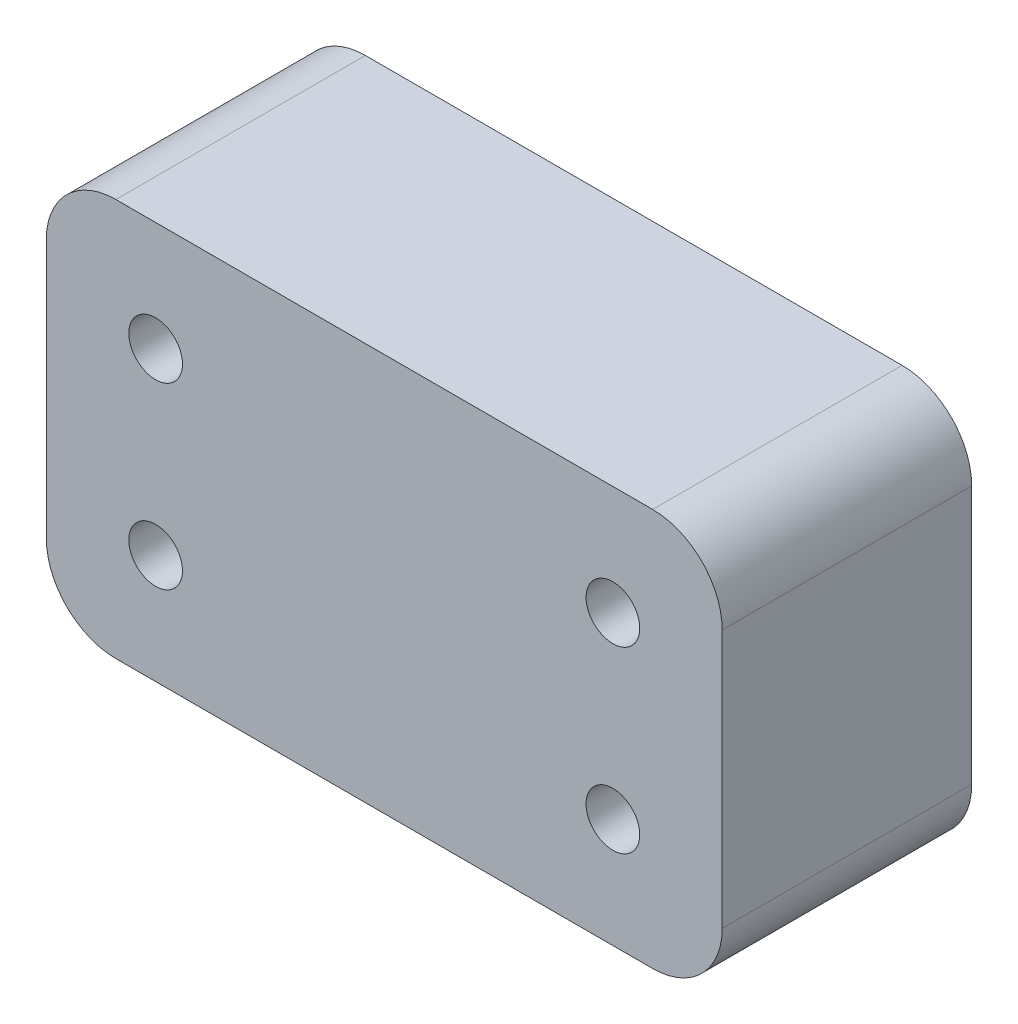
ISO-10303-21;
HEADER;
FILE_DESCRIPTION(('STEP AP214'),'2;1');
FILE_NAME('part.step','',(''),(''),'','','');
FILE_SCHEMA(('AUTOMOTIVE_DESIGN { 1 0 10303 214 1 1 1 1 }'));
ENDSEC;
DATA;
#1=APPLICATION_CONTEXT('core data for automotive mechanical design processes');
#2=APPLICATION_PROTOCOL_DEFINITION('international standard','automotive_design',2000,#1);
#3=PRODUCT_CONTEXT('',#1,'mechanical');
#4=PRODUCT('Part','Part','',(#3));
#5=PRODUCT_RELATED_PRODUCT_CATEGORY('part','',(#4));
#6=PRODUCT_DEFINITION_FORMATION('','',#4);
#7=PRODUCT_DEFINITION_CONTEXT('part definition',#1,'design');
#8=PRODUCT_DEFINITION('design','',#6,#7);
#9=PRODUCT_DEFINITION_SHAPE('','',#8);
#10=(LENGTH_UNIT() NAMED_UNIT(*) SI_UNIT(.MILLI.,.METRE.));
#11=(NAMED_UNIT(*) PLANE_ANGLE_UNIT() SI_UNIT($,.RADIAN.));
#12=(NAMED_UNIT(*) SI_UNIT($,.STERADIAN.) SOLID_ANGLE_UNIT());
#13=UNCERTAINTY_MEASURE_WITH_UNIT(LENGTH_MEASURE(1.E-05),#10,'distance_accuracy_value','');
#14=(GEOMETRIC_REPRESENTATION_CONTEXT(3) GLOBAL_UNCERTAINTY_ASSIGNED_CONTEXT((#13)) GLOBAL_UNIT_ASSIGNED_CONTEXT((#10,
#11,#12)) REPRESENTATION_CONTEXT('',''));
#15=CARTESIAN_POINT('',(0.,0.,0.));
#16=DIRECTION('',(0.,0.,1.));
#17=DIRECTION('',(1.,0.,0.));
#18=AXIS2_PLACEMENT_3D('',#15,#16,#17);
#19=CARTESIAN_POINT('',(0.,0.,25.1));
#20=DIRECTION('',(0.,0.,1.));
#21=DIRECTION('',(1.,0.,0.));
#22=AXIS2_PLACEMENT_3D('',#19,#20,#21);
#23=PLANE('',#22);
#24=CARTESIAN_POINT('',(31.905545776358,71.9999999999306,25.1));
#25=DIRECTION('',(0.,0.,1.));
#26=DIRECTION('',(1.,0.,0.));
#27=AXIS2_PLACEMENT_3D('',#24,#25,#26);
#28=CIRCLE('',#27,2.69999999999999);
#29=CARTESIAN_POINT('',(34.6055457763579,71.9999999999306,25.1));
#30=VERTEX_POINT('',#29);
#31=EDGE_CURVE('E155',#30,#30,#28,.T.);
#32=ORIENTED_EDGE('',*,*,#31,.F.);
#33=EDGE_LOOP('',(#32));
#34=FACE_BOUND('',#33,.T.);
#35=CARTESIAN_POINT('',(31.9055457763578,53.9999999999306,25.1));
#36=DIRECTION('',(0.,0.,1.));
#37=DIRECTION('',(1.,0.,0.));
#38=AXIS2_PLACEMENT_3D('',#35,#36,#37);
#39=CIRCLE('',#38,2.69999999999999);
#40=CARTESIAN_POINT('',(34.6055457763578,53.9999999999306,25.1));
#41=VERTEX_POINT('',#40);
#42=EDGE_CURVE('E161',#41,#41,#39,.T.);
#43=ORIENTED_EDGE('',*,*,#42,.F.);
#44=EDGE_LOOP('',(#43));
#45=FACE_BOUND('',#44,.T.);
#46=CARTESIAN_POINT('',(-14.0944542236422,53.9999999999308,25.1));
#47=DIRECTION('',(0.,0.,1.));
#48=DIRECTION('',(1.,0.,0.));
#49=AXIS2_PLACEMENT_3D('',#46,#47,#48);
#50=CIRCLE('',#49,2.7);
#51=CARTESIAN_POINT('',(-11.3944542236422,53.9999999999308,25.1));
#52=VERTEX_POINT('',#51);
#53=EDGE_CURVE('E167',#52,#52,#50,.T.);
#54=ORIENTED_EDGE('',*,*,#53,.F.);
#55=EDGE_LOOP('',(#54));
#56=FACE_BOUND('',#55,.T.);
#57=CARTESIAN_POINT('',(-14.0944542236421,71.9999999999308,25.1));
#58=DIRECTION('',(0.,0.,1.));
#59=DIRECTION('',(1.,0.,0.));
#60=AXIS2_PLACEMENT_3D('',#57,#58,#59);
#61=CIRCLE('',#60,2.7);
#62=CARTESIAN_POINT('',(-11.3944542236421,71.9999999999308,25.1));
#63=VERTEX_POINT('',#62);
#64=EDGE_CURVE('E44',#63,#63,#61,.T.);
#65=ORIENTED_EDGE('',*,*,#64,.F.);
#66=EDGE_LOOP('',(#65));
#67=FACE_BOUND('',#66,.T.);
#68=CARTESIAN_POINT('',(35.9055457759151,49.999999999903,25.1));
#69=DIRECTION('',(0.,0.,1.));
#70=DIRECTION('',(1.,0.,0.));
#71=AXIS2_PLACEMENT_3D('',#68,#69,#70);
#72=CIRCLE('',#71,7.00000000000001);
#73=CARTESIAN_POINT('',(35.9055457759151,42.999999999903,25.1));
#74=VERTEX_POINT('',#73);
#75=CARTESIAN_POINT('',(42.9055457759151,49.999999999903,25.1));
#76=VERTEX_POINT('',#75);
#77=EDGE_CURVE('E111',#74,#76,#72,.T.);
#78=ORIENTED_EDGE('',*,*,#77,.T.);
#79=DIRECTION('',(0.,1.,0.));
#80=VECTOR('',#79,1.);
#81=CARTESIAN_POINT('',(42.9055457759151,49.999999999903,25.1));
#82=LINE('',#81,#80);
#83=CARTESIAN_POINT('',(42.9055457759151,75.9999999995502,25.1));
#84=VERTEX_POINT('',#83);
#85=EDGE_CURVE('E118',#76,#84,#82,.T.);
#86=ORIENTED_EDGE('',*,*,#85,.T.);
#87=CARTESIAN_POINT('',(35.9055457759151,75.9999999995502,25.1));
#88=DIRECTION('',(0.,0.,1.));
#89=DIRECTION('',(1.,0.,0.));
#90=AXIS2_PLACEMENT_3D('',#87,#88,#89);
#91=CIRCLE('',#90,7.00000000000001);
#92=CARTESIAN_POINT('',(35.9055457759151,82.9999999995502,25.1));
#93=VERTEX_POINT('',#92);
#94=EDGE_CURVE('E123',#84,#93,#91,.T.);
#95=ORIENTED_EDGE('',*,*,#94,.T.);
#96=DIRECTION('',(-1.,0.,0.));
#97=VECTOR('',#96,1.);
#98=CARTESIAN_POINT('',(35.9055457759151,82.9999999995502,25.1));
#99=LINE('',#98,#97);
#100=CARTESIAN_POINT('',(-18.0944542231054,82.9999999995502,25.1));
#101=VERTEX_POINT('',#100);
#102=EDGE_CURVE('E131',#93,#101,#99,.T.);
#103=ORIENTED_EDGE('',*,*,#102,.T.);
#104=CARTESIAN_POINT('',(-18.0944542231054,75.9999999995502,25.1));
#105=DIRECTION('',(0.,0.,1.));
#106=DIRECTION('',(1.,0.,0.));
#107=AXIS2_PLACEMENT_3D('',#104,#105,#106);
#108=CIRCLE('',#107,7.);
#109=CARTESIAN_POINT('',(-25.0944542231054,75.9999999995502,25.1));
#110=VERTEX_POINT('',#109);
#111=EDGE_CURVE('E134',#101,#110,#108,.T.);
#112=ORIENTED_EDGE('',*,*,#111,.T.);
#113=DIRECTION('',(0.,-1.,0.));
#114=VECTOR('',#113,1.);
#115=CARTESIAN_POINT('',(-25.0944542231054,75.9999999995502,25.1));
#116=LINE('',#115,#114);
#117=CARTESIAN_POINT('',(-25.0944542231054,49.999999999903,25.1));
#118=VERTEX_POINT('',#117);
#119=EDGE_CURVE('E137',#110,#118,#116,.T.);
#120=ORIENTED_EDGE('',*,*,#119,.T.);
#121=CARTESIAN_POINT('',(-18.0944542231054,49.999999999903,25.1));
#122=DIRECTION('',(0.,0.,1.));
#123=DIRECTION('',(1.,0.,0.));
#124=AXIS2_PLACEMENT_3D('',#121,#122,#123);
#125=CIRCLE('',#124,7.);
#126=CARTESIAN_POINT('',(-18.0944542231054,42.999999999903,25.1));
#127=VERTEX_POINT('',#126);
#128=EDGE_CURVE('E140',#118,#127,#125,.T.);
#129=ORIENTED_EDGE('',*,*,#128,.T.);
#130=DIRECTION('',(1.,0.,0.));
#131=VECTOR('',#130,1.);
#132=CARTESIAN_POINT('',(-18.0944542231054,42.999999999903,25.1));
#133=LINE('',#132,#131);
#134=EDGE_CURVE('E115',#127,#74,#133,.T.);
#135=ORIENTED_EDGE('',*,*,#134,.T.);
#136=EDGE_LOOP('',(#78,#86,#95,#103,#112,#120,#129,#135));
#137=FACE_BOUND('',#136,.T.);
#138=ADVANCED_FACE('F35',(#34,#45,#56,#67,#137),#23,.T.);
#139=CARTESIAN_POINT('',(0.,0.,0.));
#140=DIRECTION('',(0.,0.,1.));
#141=DIRECTION('',(1.,0.,0.));
#142=AXIS2_PLACEMENT_3D('',#139,#140,#141);
#143=PLANE('',#142);
#144=CARTESIAN_POINT('',(31.905545776358,71.9999999999306,0.));
#145=DIRECTION('',(0.,0.,1.));
#146=DIRECTION('',(1.,0.,0.));
#147=AXIS2_PLACEMENT_3D('',#144,#145,#146);
#148=CIRCLE('',#147,2.69999999999999);
#149=CARTESIAN_POINT('',(34.6055457763579,71.9999999999306,0.));
#150=VERTEX_POINT('',#149);
#151=EDGE_CURVE('E158',#150,#150,#148,.T.);
#152=ORIENTED_EDGE('',*,*,#151,.T.);
#153=EDGE_LOOP('',(#152));
#154=FACE_BOUND('',#153,.T.);
#155=CARTESIAN_POINT('',(31.9055457763578,53.9999999999306,0.));
#156=DIRECTION('',(0.,0.,1.));
#157=DIRECTION('',(1.,0.,0.));
#158=AXIS2_PLACEMENT_3D('',#155,#156,#157);
#159=CIRCLE('',#158,2.69999999999999);
#160=CARTESIAN_POINT('',(34.6055457763578,53.9999999999306,0.));
#161=VERTEX_POINT('',#160);
#162=EDGE_CURVE('E164',#161,#161,#159,.T.);
#163=ORIENTED_EDGE('',*,*,#162,.T.);
#164=EDGE_LOOP('',(#163));
#165=FACE_BOUND('',#164,.T.);
#166=CARTESIAN_POINT('',(-14.0944542236422,53.9999999999308,0.));
#167=DIRECTION('',(0.,0.,1.));
#168=DIRECTION('',(1.,0.,0.));
#169=AXIS2_PLACEMENT_3D('',#166,#167,#168);
#170=CIRCLE('',#169,2.69999999999999);
#171=CARTESIAN_POINT('',(-11.3944542236422,53.9999999999308,0.));
#172=VERTEX_POINT('',#171);
#173=EDGE_CURVE('E170',#172,#172,#170,.T.);
#174=ORIENTED_EDGE('',*,*,#173,.T.);
#175=EDGE_LOOP('',(#174));
#176=FACE_BOUND('',#175,.T.);
#177=CARTESIAN_POINT('',(-14.0944542236421,71.9999999999308,0.));
#178=DIRECTION('',(0.,0.,1.));
#179=DIRECTION('',(1.,0.,0.));
#180=AXIS2_PLACEMENT_3D('',#177,#178,#179);
#181=CIRCLE('',#180,2.69999999999999);
#182=CARTESIAN_POINT('',(-11.3944542236421,71.9999999999308,0.));
#183=VERTEX_POINT('',#182);
#184=EDGE_CURVE('E11',#183,#183,#181,.T.);
#185=ORIENTED_EDGE('',*,*,#184,.T.);
#186=EDGE_LOOP('',(#185));
#187=FACE_BOUND('',#186,.T.);
#188=CARTESIAN_POINT('',(35.9055457759151,49.999999999903,0.));
#189=DIRECTION('',(0.,0.,1.));
#190=DIRECTION('',(1.,0.,0.));
#191=AXIS2_PLACEMENT_3D('',#188,#189,#190);
#192=CIRCLE('',#191,7.00000000000001);
#193=CARTESIAN_POINT('',(42.9055457759151,49.999999999903,0.));
#194=VERTEX_POINT('',#193);
#195=CARTESIAN_POINT('',(35.9055457759151,42.999999999903,0.));
#196=VERTEX_POINT('',#195);
#197=EDGE_CURVE('E52',#194,#196,#192,.F.);
#198=ORIENTED_EDGE('',*,*,#197,.T.);
#199=DIRECTION('',(-1.,0.,0.));
#200=VECTOR('',#199,1.);
#201=CARTESIAN_POINT('',(-18.0944542231054,42.999999999903,0.));
#202=LINE('',#201,#200);
#203=CARTESIAN_POINT('',(-18.0944542231054,42.999999999903,0.));
#204=VERTEX_POINT('',#203);
#205=EDGE_CURVE('E230',#196,#204,#202,.T.);
#206=ORIENTED_EDGE('',*,*,#205,.T.);
#207=CARTESIAN_POINT('',(-18.0944542231054,49.999999999903,0.));
#208=DIRECTION('',(0.,0.,1.));
#209=DIRECTION('',(1.,0.,0.));
#210=AXIS2_PLACEMENT_3D('',#207,#208,#209);
#211=CIRCLE('',#210,7.);
#212=CARTESIAN_POINT('',(-25.0944542231054,49.999999999903,0.));
#213=VERTEX_POINT('',#212);
#214=EDGE_CURVE('E232',#204,#213,#211,.F.);
#215=ORIENTED_EDGE('',*,*,#214,.T.);
#216=DIRECTION('',(0.,1.,0.));
#217=VECTOR('',#216,1.);
#218=CARTESIAN_POINT('',(-25.0944542231054,75.9999999995502,0.));
#219=LINE('',#218,#217);
#220=CARTESIAN_POINT('',(-25.0944542231054,75.9999999995502,0.));
#221=VERTEX_POINT('',#220);
#222=EDGE_CURVE('E233',#213,#221,#219,.T.);
#223=ORIENTED_EDGE('',*,*,#222,.T.);
#224=CARTESIAN_POINT('',(-18.0944542231054,75.9999999995502,0.));
#225=DIRECTION('',(0.,0.,1.));
#226=DIRECTION('',(1.,0.,0.));
#227=AXIS2_PLACEMENT_3D('',#224,#225,#226);
#228=CIRCLE('',#227,7.);
#229=CARTESIAN_POINT('',(-18.0944542231054,82.9999999995502,0.));
#230=VERTEX_POINT('',#229);
#231=EDGE_CURVE('E237',#221,#230,#228,.F.);
#232=ORIENTED_EDGE('',*,*,#231,.T.);
#233=DIRECTION('',(1.,0.,0.));
#234=VECTOR('',#233,1.);
#235=CARTESIAN_POINT('',(35.9055457759151,82.9999999995502,0.));
#236=LINE('',#235,#234);
#237=CARTESIAN_POINT('',(35.9055457759151,82.9999999995502,0.));
#238=VERTEX_POINT('',#237);
#239=EDGE_CURVE('E71',#230,#238,#236,.T.);
#240=ORIENTED_EDGE('',*,*,#239,.T.);
#241=CARTESIAN_POINT('',(35.9055457759151,75.9999999995502,0.));
#242=DIRECTION('',(0.,0.,1.));
#243=DIRECTION('',(1.,0.,0.));
#244=AXIS2_PLACEMENT_3D('',#241,#242,#243);
#245=CIRCLE('',#244,7.00000000000001);
#246=CARTESIAN_POINT('',(42.9055457759151,75.9999999995502,0.));
#247=VERTEX_POINT('',#246);
#248=EDGE_CURVE('E76',#238,#247,#245,.F.);
#249=ORIENTED_EDGE('',*,*,#248,.T.);
#250=DIRECTION('',(0.,-1.,0.));
#251=VECTOR('',#250,1.);
#252=CARTESIAN_POINT('',(42.9055457759151,49.999999999903,0.));
#253=LINE('',#252,#251);
#254=EDGE_CURVE('E74',#247,#194,#253,.T.);
#255=ORIENTED_EDGE('',*,*,#254,.T.);
#256=EDGE_LOOP('',(#198,#206,#215,#223,#232,#240,#249,#255));
#257=FACE_BOUND('',#256,.T.);
#258=ADVANCED_FACE('F37',(#154,#165,#176,#187,#257),#143,.F.);
#259=CARTESIAN_POINT('',(-14.0944542236421,71.9999999999308,25.1));
#260=DIRECTION('',(0.,0.,1.));
#261=DIRECTION('',(1.,0.,0.));
#262=AXIS2_PLACEMENT_3D('',#259,#260,#261);
#263=CYLINDRICAL_SURFACE('',#262,2.7);
#264=ORIENTED_EDGE('',*,*,#184,.F.);
#265=EDGE_LOOP('',(#264));
#266=FACE_BOUND('',#265,.T.);
#267=ORIENTED_EDGE('',*,*,#64,.T.);
#268=EDGE_LOOP('',(#267));
#269=FACE_BOUND('',#268,.T.);
#270=ADVANCED_FACE('F175',(#266,#269),#263,.F.);
#271=CARTESIAN_POINT('',(-14.0944542236422,53.9999999999308,25.1));
#272=DIRECTION('',(0.,0.,1.));
#273=DIRECTION('',(1.,0.,0.));
#274=AXIS2_PLACEMENT_3D('',#271,#272,#273);
#275=CYLINDRICAL_SURFACE('',#274,2.7);
#276=ORIENTED_EDGE('',*,*,#173,.F.);
#277=EDGE_LOOP('',(#276));
#278=FACE_BOUND('',#277,.T.);
#279=ORIENTED_EDGE('',*,*,#53,.T.);
#280=EDGE_LOOP('',(#279));
#281=FACE_BOUND('',#280,.T.);
#282=ADVANCED_FACE('F188',(#278,#281),#275,.F.);
#283=CARTESIAN_POINT('',(31.9055457763578,53.9999999999306,25.1));
#284=DIRECTION('',(0.,0.,1.));
#285=DIRECTION('',(1.,0.,0.));
#286=AXIS2_PLACEMENT_3D('',#283,#284,#285);
#287=CYLINDRICAL_SURFACE('',#286,2.69999999999999);
#288=ORIENTED_EDGE('',*,*,#162,.F.);
#289=EDGE_LOOP('',(#288));
#290=FACE_BOUND('',#289,.T.);
#291=ORIENTED_EDGE('',*,*,#42,.T.);
#292=EDGE_LOOP('',(#291));
#293=FACE_BOUND('',#292,.T.);
#294=ADVANCED_FACE('F192',(#290,#293),#287,.F.);
#295=CARTESIAN_POINT('',(31.905545776358,71.9999999999306,25.1));
#296=DIRECTION('',(0.,0.,1.));
#297=DIRECTION('',(1.,0.,0.));
#298=AXIS2_PLACEMENT_3D('',#295,#296,#297);
#299=CYLINDRICAL_SURFACE('',#298,2.69999999999999);
#300=ORIENTED_EDGE('',*,*,#151,.F.);
#301=EDGE_LOOP('',(#300));
#302=FACE_BOUND('',#301,.T.);
#303=ORIENTED_EDGE('',*,*,#31,.T.);
#304=EDGE_LOOP('',(#303));
#305=FACE_BOUND('',#304,.T.);
#306=ADVANCED_FACE('F196',(#302,#305),#299,.F.);
#307=CARTESIAN_POINT('',(42.9055457759151,49.999999999903,-78.8923316922409));
#308=DIRECTION('',(1.,0.,0.));
#309=DIRECTION('',(0.,0.,-1.));
#310=AXIS2_PLACEMENT_3D('',#307,#308,#309);
#311=PLANE('',#310);
#312=ORIENTED_EDGE('',*,*,#254,.F.);
#313=DIRECTION('',(0.,0.,1.));
#314=VECTOR('',#313,1.);
#315=CARTESIAN_POINT('',(42.9055457759151,75.9999999995502,-78.8923316922409));
#316=LINE('',#315,#314);
#317=EDGE_CURVE('E114',#247,#84,#316,.T.);
#318=ORIENTED_EDGE('',*,*,#317,.T.);
#319=ORIENTED_EDGE('',*,*,#85,.F.);
#320=DIRECTION('',(0.,0.,1.));
#321=VECTOR('',#320,1.);
#322=CARTESIAN_POINT('',(42.9055457759151,49.999999999903,-78.8923316922409));
#323=LINE('',#322,#321);
#324=EDGE_CURVE('E107',#194,#76,#323,.T.);
#325=ORIENTED_EDGE('',*,*,#324,.F.);
#326=EDGE_LOOP('',(#312,#318,#319,#325));
#327=FACE_BOUND('',#326,.T.);
#328=ADVANCED_FACE('F119',(#327),#311,.T.);
#329=CARTESIAN_POINT('',(35.9055457759151,75.9999999995502,-78.8923316922409));
#330=DIRECTION('',(0.,0.,1.));
#331=DIRECTION('',(1.,0.,0.));
#332=AXIS2_PLACEMENT_3D('',#329,#330,#331);
#333=CYLINDRICAL_SURFACE('',#332,7.00000000000001);
#334=ORIENTED_EDGE('',*,*,#248,.F.);
#335=DIRECTION('',(0.,0.,1.));
#336=VECTOR('',#335,1.);
#337=CARTESIAN_POINT('',(35.9055457759151,82.9999999995502,-78.8923316922409));
#338=LINE('',#337,#336);
#339=EDGE_CURVE('E152',#238,#93,#338,.T.);
#340=ORIENTED_EDGE('',*,*,#339,.T.);
#341=ORIENTED_EDGE('',*,*,#94,.F.);
#342=ORIENTED_EDGE('',*,*,#317,.F.);
#343=EDGE_LOOP('',(#334,#340,#341,#342));
#344=FACE_BOUND('',#343,.T.);
#345=ADVANCED_FACE('F206',(#344),#333,.T.);
#346=CARTESIAN_POINT('',(35.9055457759151,82.9999999995502,-78.8923316922409));
#347=DIRECTION('',(0.,1.,0.));
#348=DIRECTION('',(0.,0.,1.));
#349=AXIS2_PLACEMENT_3D('',#346,#347,#348);
#350=PLANE('',#349);
#351=ORIENTED_EDGE('',*,*,#239,.F.);
#352=DIRECTION('',(0.,0.,1.));
#353=VECTOR('',#352,1.);
#354=CARTESIAN_POINT('',(-18.0944542231054,82.9999999995502,-78.8923316922409));
#355=LINE('',#354,#353);
#356=EDGE_CURVE('E150',#230,#101,#355,.T.);
#357=ORIENTED_EDGE('',*,*,#356,.T.);
#358=ORIENTED_EDGE('',*,*,#102,.F.);
#359=ORIENTED_EDGE('',*,*,#339,.F.);
#360=EDGE_LOOP('',(#351,#357,#358,#359));
#361=FACE_BOUND('',#360,.T.);
#362=ADVANCED_FACE('F209',(#361),#350,.T.);
#363=CARTESIAN_POINT('',(-18.0944542231054,75.9999999995502,-78.8923316922409));
#364=DIRECTION('',(0.,0.,1.));
#365=DIRECTION('',(1.,0.,0.));
#366=AXIS2_PLACEMENT_3D('',#363,#364,#365);
#367=CYLINDRICAL_SURFACE('',#366,7.);
#368=ORIENTED_EDGE('',*,*,#231,.F.);
#369=DIRECTION('',(0.,0.,1.));
#370=VECTOR('',#369,1.);
#371=CARTESIAN_POINT('',(-25.0944542231054,75.9999999995502,-78.8923316922409));
#372=LINE('',#371,#370);
#373=EDGE_CURVE('E148',#221,#110,#372,.T.);
#374=ORIENTED_EDGE('',*,*,#373,.T.);
#375=ORIENTED_EDGE('',*,*,#111,.F.);
#376=ORIENTED_EDGE('',*,*,#356,.F.);
#377=EDGE_LOOP('',(#368,#374,#375,#376));
#378=FACE_BOUND('',#377,.T.);
#379=ADVANCED_FACE('F213',(#378),#367,.T.);
#380=CARTESIAN_POINT('',(-25.0944542231054,75.9999999995502,-78.8923316922409));
#381=DIRECTION('',(-1.,0.,0.));
#382=DIRECTION('',(0.,-1.,0.));
#383=AXIS2_PLACEMENT_3D('',#380,#381,#382);
#384=PLANE('',#383);
#385=ORIENTED_EDGE('',*,*,#222,.F.);
#386=DIRECTION('',(0.,0.,1.));
#387=VECTOR('',#386,1.);
#388=CARTESIAN_POINT('',(-25.0944542231054,49.999999999903,-78.8923316922409));
#389=LINE('',#388,#387);
#390=EDGE_CURVE('E146',#213,#118,#389,.T.);
#391=ORIENTED_EDGE('',*,*,#390,.T.);
#392=ORIENTED_EDGE('',*,*,#119,.F.);
#393=ORIENTED_EDGE('',*,*,#373,.F.);
#394=EDGE_LOOP('',(#385,#391,#392,#393));
#395=FACE_BOUND('',#394,.T.);
#396=ADVANCED_FACE('F217',(#395),#384,.T.);
#397=CARTESIAN_POINT('',(-18.0944542231054,49.999999999903,-78.8923316922409));
#398=DIRECTION('',(0.,0.,1.));
#399=DIRECTION('',(1.,0.,0.));
#400=AXIS2_PLACEMENT_3D('',#397,#398,#399);
#401=CYLINDRICAL_SURFACE('',#400,7.);
#402=ORIENTED_EDGE('',*,*,#214,.F.);
#403=DIRECTION('',(0.,0.,1.));
#404=VECTOR('',#403,1.);
#405=CARTESIAN_POINT('',(-18.0944542231054,42.999999999903,-78.8923316922409));
#406=LINE('',#405,#404);
#407=EDGE_CURVE('E144',#204,#127,#406,.T.);
#408=ORIENTED_EDGE('',*,*,#407,.T.);
#409=ORIENTED_EDGE('',*,*,#128,.F.);
#410=ORIENTED_EDGE('',*,*,#390,.F.);
#411=EDGE_LOOP('',(#402,#408,#409,#410));
#412=FACE_BOUND('',#411,.T.);
#413=ADVANCED_FACE('F221',(#412),#401,.T.);
#414=CARTESIAN_POINT('',(-18.0944542231054,42.999999999903,-78.8923316922409));
#415=DIRECTION('',(0.,-1.,0.));
#416=DIRECTION('',(1.,0.,0.));
#417=AXIS2_PLACEMENT_3D('',#414,#415,#416);
#418=PLANE('',#417);
#419=ORIENTED_EDGE('',*,*,#205,.F.);
#420=DIRECTION('',(0.,0.,1.));
#421=VECTOR('',#420,1.);
#422=CARTESIAN_POINT('',(35.9055457759151,42.999999999903,-78.8923316922409));
#423=LINE('',#422,#421);
#424=EDGE_CURVE('E83',#196,#74,#423,.T.);
#425=ORIENTED_EDGE('',*,*,#424,.T.);
#426=ORIENTED_EDGE('',*,*,#134,.F.);
#427=ORIENTED_EDGE('',*,*,#407,.F.);
#428=EDGE_LOOP('',(#419,#425,#426,#427));
#429=FACE_BOUND('',#428,.T.);
#430=ADVANCED_FACE('F203',(#429),#418,.T.);
#431=CARTESIAN_POINT('',(35.9055457759151,49.999999999903,-78.8923316922409));
#432=DIRECTION('',(0.,0.,1.));
#433=DIRECTION('',(1.,0.,0.));
#434=AXIS2_PLACEMENT_3D('',#431,#432,#433);
#435=CYLINDRICAL_SURFACE('',#434,7.00000000000001);
#436=ORIENTED_EDGE('',*,*,#197,.F.);
#437=ORIENTED_EDGE('',*,*,#324,.T.);
#438=ORIENTED_EDGE('',*,*,#77,.F.);
#439=ORIENTED_EDGE('',*,*,#424,.F.);
#440=EDGE_LOOP('',(#436,#437,#438,#439));
#441=FACE_BOUND('',#440,.T.);
#442=ADVANCED_FACE('F109',(#441),#435,.T.);
#443=CLOSED_SHELL('',(#138,#258,#270,#282,#294,#306,#328,#345,#362,#379,#396,#413,#430,#442));
#444=MANIFOLD_SOLID_BREP('B2',#443);
#445=ADVANCED_BREP_SHAPE_REPRESENTATION('',(#18,#444),#14);
#446=SHAPE_DEFINITION_REPRESENTATION(#9,#445);
ENDSEC;
END-ISO-10303-21;
